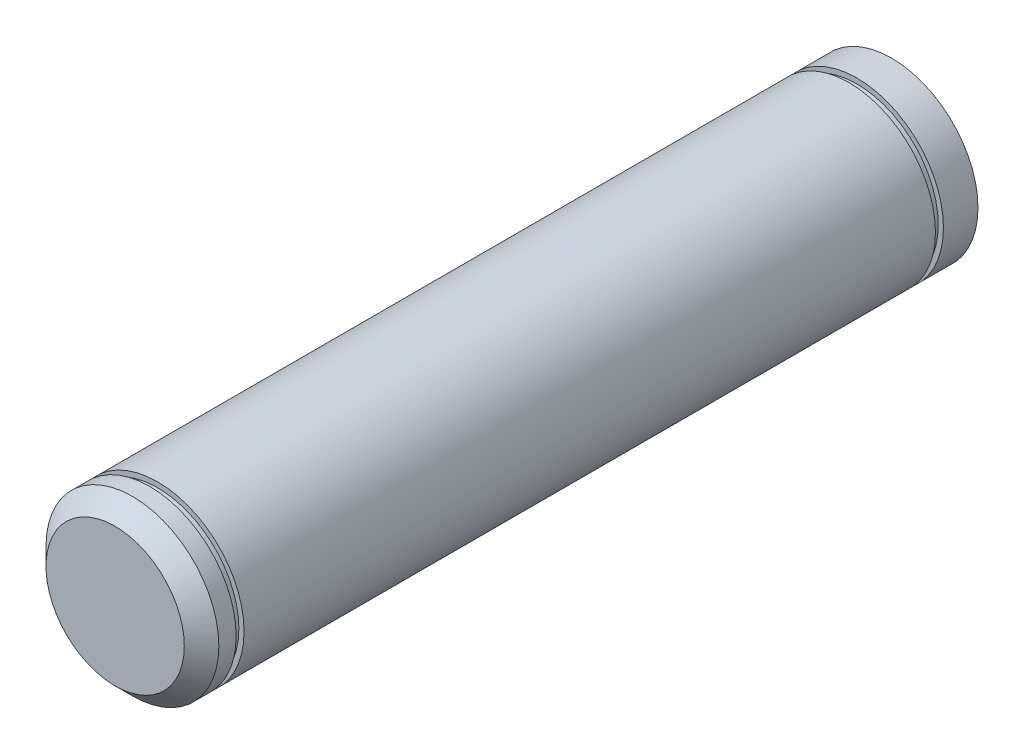
ISO-10303-21;
HEADER;
FILE_DESCRIPTION(('STEP AP214'),'2;1');
FILE_NAME('part.step','',(''),(''),'','','');
FILE_SCHEMA(('AUTOMOTIVE_DESIGN { 1 0 10303 214 1 1 1 1 }'));
ENDSEC;
DATA;
#1=APPLICATION_CONTEXT('core data for automotive mechanical design processes');
#2=APPLICATION_PROTOCOL_DEFINITION('international standard','automotive_design',2000,#1);
#3=PRODUCT_CONTEXT('',#1,'mechanical');
#4=PRODUCT('Part','Part','',(#3));
#5=PRODUCT_RELATED_PRODUCT_CATEGORY('part','',(#4));
#6=PRODUCT_DEFINITION_FORMATION('','',#4);
#7=PRODUCT_DEFINITION_CONTEXT('part definition',#1,'design');
#8=PRODUCT_DEFINITION('design','',#6,#7);
#9=PRODUCT_DEFINITION_SHAPE('','',#8);
#10=(LENGTH_UNIT() NAMED_UNIT(*) SI_UNIT(.MILLI.,.METRE.));
#11=(NAMED_UNIT(*) PLANE_ANGLE_UNIT() SI_UNIT($,.RADIAN.));
#12=(NAMED_UNIT(*) SI_UNIT($,.STERADIAN.) SOLID_ANGLE_UNIT());
#13=UNCERTAINTY_MEASURE_WITH_UNIT(LENGTH_MEASURE(1.E-05),#10,'distance_accuracy_value','');
#14=(GEOMETRIC_REPRESENTATION_CONTEXT(3) GLOBAL_UNCERTAINTY_ASSIGNED_CONTEXT((#13)) GLOBAL_UNIT_ASSIGNED_CONTEXT((#10,
#11,#12)) REPRESENTATION_CONTEXT('',''));
#15=CARTESIAN_POINT('',(0.,0.,0.));
#16=DIRECTION('',(0.,0.,1.));
#17=DIRECTION('',(1.,0.,0.));
#18=AXIS2_PLACEMENT_3D('',#15,#16,#17);
#19=CARTESIAN_POINT('',(0.,0.,304.8));
#20=DIRECTION('',(0.,0.,-1.));
#21=DIRECTION('',(-1.,0.,0.));
#22=AXIS2_PLACEMENT_3D('',#19,#20,#21);
#23=CYLINDRICAL_SURFACE('',#22,12.7);
#24=CARTESIAN_POINT('',(0.,0.,298.5516));
#25=DIRECTION('',(0.,0.,1.));
#26=DIRECTION('',(1.,0.,0.));
#27=AXIS2_PLACEMENT_3D('',#24,#25,#26);
#28=CIRCLE('',#27,12.7);
#29=CARTESIAN_POINT('',(12.7,0.,298.5516));
#30=VERTEX_POINT('',#29);
#31=EDGE_CURVE('E60',#30,#30,#28,.T.);
#32=ORIENTED_EDGE('',*,*,#31,.F.);
#33=EDGE_LOOP('',(#32));
#34=FACE_BOUND('',#33,.T.);
#35=CARTESIAN_POINT('',(0.,0.,196.9484));
#36=DIRECTION('',(0.,0.,1.));
#37=DIRECTION('',(1.,0.,0.));
#38=AXIS2_PLACEMENT_3D('',#35,#36,#37);
#39=CIRCLE('',#38,12.7);
#40=CARTESIAN_POINT('',(12.7,0.,196.9484));
#41=VERTEX_POINT('',#40);
#42=EDGE_CURVE('E74',#41,#41,#39,.T.);
#43=ORIENTED_EDGE('',*,*,#42,.T.);
#44=EDGE_LOOP('',(#43));
#45=FACE_BOUND('',#44,.T.);
#46=ADVANCED_FACE('F38',(#34,#45),#23,.T.);
#47=CARTESIAN_POINT('',(0.,0.,299.72));
#48=DIRECTION('',(0.,0.,1.));
#49=DIRECTION('',(1.,0.,0.));
#50=AXIS2_PLACEMENT_3D('',#47,#48,#49);
#51=CIRCLE('',#50,12.7);
#52=CARTESIAN_POINT('',(12.7,0.,299.72));
#53=VERTEX_POINT('',#52);
#54=EDGE_CURVE('E63',#53,#53,#51,.T.);
#55=ORIENTED_EDGE('',*,*,#54,.T.);
#56=EDGE_LOOP('',(#55));
#57=FACE_BOUND('',#56,.T.);
#58=CARTESIAN_POINT('',(0.,0.,302.26));
#59=DIRECTION('',(0.,0.,1.));
#60=DIRECTION('',(1.,0.,0.));
#61=AXIS2_PLACEMENT_3D('',#58,#59,#60);
#62=CIRCLE('',#61,12.7);
#63=CARTESIAN_POINT('',(12.7,0.,302.26));
#64=VERTEX_POINT('',#63);
#65=EDGE_CURVE('E46',#64,#64,#62,.F.);
#66=ORIENTED_EDGE('',*,*,#65,.T.);
#67=EDGE_LOOP('',(#66));
#68=FACE_BOUND('',#67,.T.);
#69=ADVANCED_FACE('F112',(#57,#68),#23,.T.);
#70=CARTESIAN_POINT('',(0.,0.,304.8));
#71=DIRECTION('',(0.,0.,1.));
#72=DIRECTION('',(1.,0.,0.));
#73=AXIS2_PLACEMENT_3D('',#70,#71,#72);
#74=PLANE('',#73);
#75=CARTESIAN_POINT('',(0.,0.,304.8));
#76=DIRECTION('',(0.,0.,1.));
#77=DIRECTION('',(1.,0.,0.));
#78=AXIS2_PLACEMENT_3D('',#75,#76,#77);
#79=CIRCLE('',#78,10.1600000000003);
#80=CARTESIAN_POINT('',(10.1600000000003,0.,304.8));
#81=VERTEX_POINT('',#80);
#82=EDGE_CURVE('E10',#81,#81,#79,.T.);
#83=ORIENTED_EDGE('',*,*,#82,.T.);
#84=EDGE_LOOP('',(#83));
#85=FACE_BOUND('',#84,.T.);
#86=ADVANCED_FACE('F118',(#85),#74,.T.);
#87=CARTESIAN_POINT('',(0.,0.,304.8));
#88=DIRECTION('',(0.,0.,-1.));
#89=DIRECTION('',(-1.,0.,0.));
#90=AXIS2_PLACEMENT_3D('',#87,#88,#89);
#91=CONICAL_SURFACE('',#90,10.1600000000003,0.785398163397451);
#92=ORIENTED_EDGE('',*,*,#65,.F.);
#93=EDGE_LOOP('',(#92));
#94=FACE_BOUND('',#93,.T.);
#95=ORIENTED_EDGE('',*,*,#82,.F.);
#96=EDGE_LOOP('',(#95));
#97=FACE_BOUND('',#96,.T.);
#98=ADVANCED_FACE('F40',(#94,#97),#91,.T.);
#99=CARTESIAN_POINT('',(0.,0.,298.5516));
#100=DIRECTION('',(0.,0.,1.));
#101=DIRECTION('',(1.,0.,0.));
#102=AXIS2_PLACEMENT_3D('',#99,#100,#101);
#103=PLANE('',#102);
#104=CARTESIAN_POINT('',(0.,0.,298.5516));
#105=DIRECTION('',(0.,0.,1.));
#106=DIRECTION('',(1.,0.,0.));
#107=AXIS2_PLACEMENT_3D('',#104,#105,#106);
#108=CIRCLE('',#107,11.938);
#109=CARTESIAN_POINT('',(11.938,0.,298.5516));
#110=VERTEX_POINT('',#109);
#111=EDGE_CURVE('E66',#110,#110,#108,.T.);
#112=ORIENTED_EDGE('',*,*,#111,.F.);
#113=EDGE_LOOP('',(#112));
#114=FACE_BOUND('',#113,.T.);
#115=ORIENTED_EDGE('',*,*,#31,.T.);
#116=EDGE_LOOP('',(#115));
#117=FACE_BOUND('',#116,.T.);
#118=ADVANCED_FACE('F142',(#114,#117),#103,.T.);
#119=CARTESIAN_POINT('',(0.,0.,299.72));
#120=DIRECTION('',(0.,0.,1.));
#121=DIRECTION('',(1.,0.,0.));
#122=AXIS2_PLACEMENT_3D('',#119,#120,#121);
#123=PLANE('',#122);
#124=CARTESIAN_POINT('',(0.,0.,299.72));
#125=DIRECTION('',(0.,0.,1.));
#126=DIRECTION('',(1.,0.,0.));
#127=AXIS2_PLACEMENT_3D('',#124,#125,#126);
#128=CIRCLE('',#127,11.938);
#129=CARTESIAN_POINT('',(11.938,0.,299.72));
#130=VERTEX_POINT('',#129);
#131=EDGE_CURVE('E70',#130,#130,#128,.T.);
#132=ORIENTED_EDGE('',*,*,#131,.T.);
#133=EDGE_LOOP('',(#132));
#134=FACE_BOUND('',#133,.T.);
#135=ORIENTED_EDGE('',*,*,#54,.F.);
#136=EDGE_LOOP('',(#135));
#137=FACE_BOUND('',#136,.T.);
#138=ADVANCED_FACE('F136',(#134,#137),#123,.F.);
#139=CARTESIAN_POINT('',(0.,0.,298.5516));
#140=DIRECTION('',(0.,0.,1.));
#141=DIRECTION('',(1.,0.,0.));
#142=AXIS2_PLACEMENT_3D('',#139,#140,#141);
#143=CYLINDRICAL_SURFACE('',#142,11.938);
#144=ORIENTED_EDGE('',*,*,#111,.T.);
#145=EDGE_LOOP('',(#144));
#146=FACE_BOUND('',#145,.T.);
#147=ORIENTED_EDGE('',*,*,#131,.F.);
#148=EDGE_LOOP('',(#147));
#149=FACE_BOUND('',#148,.T.);
#150=ADVANCED_FACE('F107',(#146,#149),#143,.T.);
#151=CARTESIAN_POINT('',(0.,0.,196.9484));
#152=DIRECTION('',(0.,0.,-1.));
#153=DIRECTION('',(1.,0.,0.));
#154=AXIS2_PLACEMENT_3D('',#151,#152,#153);
#155=PLANE('',#154);
#156=ORIENTED_EDGE('',*,*,#42,.F.);
#157=EDGE_LOOP('',(#156));
#158=FACE_BOUND('',#157,.T.);
#159=CARTESIAN_POINT('',(0.,0.,196.9484));
#160=DIRECTION('',(0.,0.,1.));
#161=DIRECTION('',(1.,0.,0.));
#162=AXIS2_PLACEMENT_3D('',#159,#160,#161);
#163=CIRCLE('',#162,11.938);
#164=CARTESIAN_POINT('',(11.938,0.,196.9484));
#165=VERTEX_POINT('',#164);
#166=EDGE_CURVE('E80',#165,#165,#163,.T.);
#167=ORIENTED_EDGE('',*,*,#166,.T.);
#168=EDGE_LOOP('',(#167));
#169=FACE_BOUND('',#168,.T.);
#170=ADVANCED_FACE('F91',(#158,#169),#155,.T.);
#171=CARTESIAN_POINT('',(0.,0.,195.78));
#172=DIRECTION('',(0.,0.,-1.));
#173=DIRECTION('',(1.,0.,0.));
#174=AXIS2_PLACEMENT_3D('',#171,#172,#173);
#175=PLANE('',#174);
#176=CARTESIAN_POINT('',(0.,0.,195.78));
#177=DIRECTION('',(0.,0.,1.));
#178=DIRECTION('',(1.,0.,0.));
#179=AXIS2_PLACEMENT_3D('',#176,#177,#178);
#180=CIRCLE('',#179,12.7);
#181=CARTESIAN_POINT('',(12.7,0.,195.78));
#182=VERTEX_POINT('',#181);
#183=EDGE_CURVE('E77',#182,#182,#180,.T.);
#184=ORIENTED_EDGE('',*,*,#183,.T.);
#185=EDGE_LOOP('',(#184));
#186=FACE_BOUND('',#185,.T.);
#187=CARTESIAN_POINT('',(0.,0.,195.78));
#188=DIRECTION('',(0.,0.,1.));
#189=DIRECTION('',(1.,0.,0.));
#190=AXIS2_PLACEMENT_3D('',#187,#188,#189);
#191=CIRCLE('',#190,11.938);
#192=CARTESIAN_POINT('',(11.938,0.,195.78));
#193=VERTEX_POINT('',#192);
#194=EDGE_CURVE('E83',#193,#193,#191,.T.);
#195=ORIENTED_EDGE('',*,*,#194,.F.);
#196=EDGE_LOOP('',(#195));
#197=FACE_BOUND('',#196,.T.);
#198=ADVANCED_FACE('F97',(#186,#197),#175,.F.);
#199=CARTESIAN_POINT('',(0.,0.,196.9484));
#200=DIRECTION('',(0.,0.,-1.));
#201=DIRECTION('',(-1.,0.,0.));
#202=AXIS2_PLACEMENT_3D('',#199,#200,#201);
#203=CYLINDRICAL_SURFACE('',#202,11.938);
#204=ORIENTED_EDGE('',*,*,#166,.F.);
#205=EDGE_LOOP('',(#204));
#206=FACE_BOUND('',#205,.T.);
#207=ORIENTED_EDGE('',*,*,#194,.T.);
#208=EDGE_LOOP('',(#207));
#209=FACE_BOUND('',#208,.T.);
#210=ADVANCED_FACE('F93',(#206,#209),#203,.T.);
#211=CARTESIAN_POINT('',(0.,0.,190.7));
#212=DIRECTION('',(0.,0.,1.));
#213=DIRECTION('',(1.,0.,0.));
#214=AXIS2_PLACEMENT_3D('',#211,#212,#213);
#215=PLANE('',#214);
#216=CARTESIAN_POINT('',(0.,0.,190.7));
#217=DIRECTION('',(0.,0.,1.));
#218=DIRECTION('',(1.,0.,0.));
#219=AXIS2_PLACEMENT_3D('',#216,#217,#218);
#220=CIRCLE('',#219,12.7);
#221=CARTESIAN_POINT('',(12.7,0.,190.7));
#222=VERTEX_POINT('',#221);
#223=EDGE_CURVE('E53',#222,#222,#220,.T.);
#224=ORIENTED_EDGE('',*,*,#223,.F.);
#225=EDGE_LOOP('',(#224));
#226=FACE_BOUND('',#225,.T.);
#227=ADVANCED_FACE('F96',(#226),#215,.F.);
#228=ORIENTED_EDGE('',*,*,#183,.F.);
#229=EDGE_LOOP('',(#228));
#230=FACE_BOUND('',#229,.T.);
#231=ORIENTED_EDGE('',*,*,#223,.T.);
#232=EDGE_LOOP('',(#231));
#233=FACE_BOUND('',#232,.T.);
#234=ADVANCED_FACE('F114',(#230,#233),#23,.T.);
#235=CLOSED_SHELL('',(#46,#69,#86,#98,#118,#138,#150,#170,#198,#210,#227,#234));
#236=MANIFOLD_SOLID_BREP('B2',#235);
#237=ADVANCED_BREP_SHAPE_REPRESENTATION('',(#18,#236),#14);
#238=SHAPE_DEFINITION_REPRESENTATION(#9,#237);
ENDSEC;
END-ISO-10303-21;
